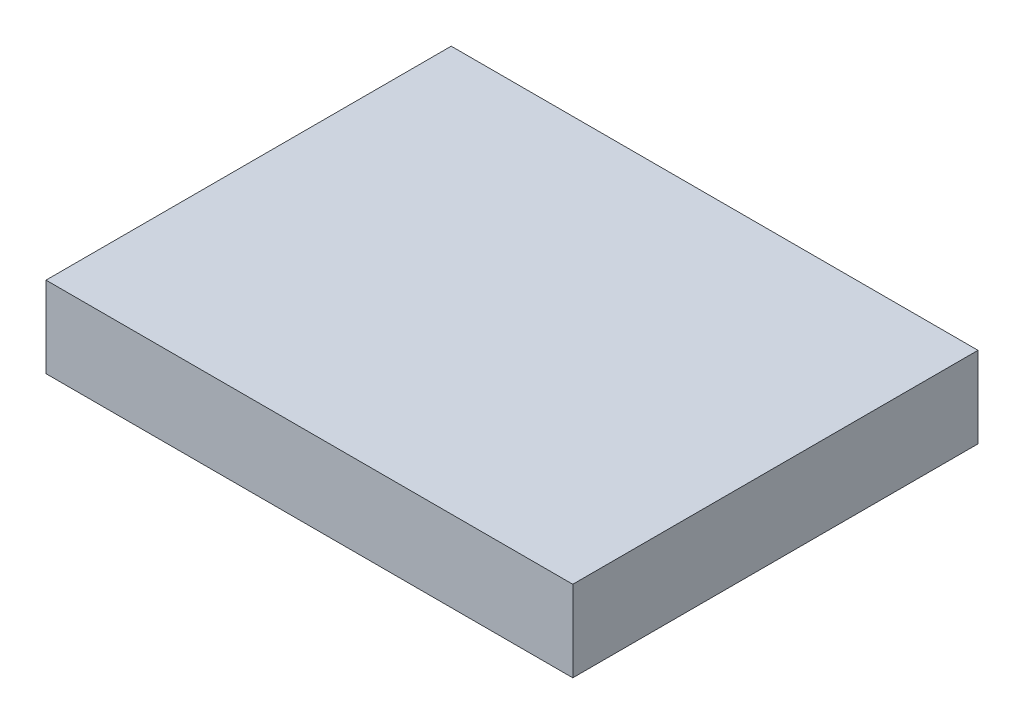
ISO-10303-21;
HEADER;
FILE_DESCRIPTION(('STEP AP214'),'2;1');
FILE_NAME('part.step','',(''),(''),'','','');
FILE_SCHEMA(('AUTOMOTIVE_DESIGN { 1 0 10303 214 1 1 1 1 }'));
ENDSEC;
DATA;
#1=APPLICATION_CONTEXT('core data for automotive mechanical design processes');
#2=APPLICATION_PROTOCOL_DEFINITION('international standard','automotive_design',2000,#1);
#3=PRODUCT_CONTEXT('',#1,'mechanical');
#4=PRODUCT('Part','Part','',(#3));
#5=PRODUCT_RELATED_PRODUCT_CATEGORY('part','',(#4));
#6=PRODUCT_DEFINITION_FORMATION('','',#4);
#7=PRODUCT_DEFINITION_CONTEXT('part definition',#1,'design');
#8=PRODUCT_DEFINITION('design','',#6,#7);
#9=PRODUCT_DEFINITION_SHAPE('','',#8);
#10=(LENGTH_UNIT() NAMED_UNIT(*) SI_UNIT(.MILLI.,.METRE.));
#11=(NAMED_UNIT(*) PLANE_ANGLE_UNIT() SI_UNIT($,.RADIAN.));
#12=(NAMED_UNIT(*) SI_UNIT($,.STERADIAN.) SOLID_ANGLE_UNIT());
#13=UNCERTAINTY_MEASURE_WITH_UNIT(LENGTH_MEASURE(1.E-05),#10,'distance_accuracy_value','');
#14=(GEOMETRIC_REPRESENTATION_CONTEXT(3) GLOBAL_UNCERTAINTY_ASSIGNED_CONTEXT((#13)) GLOBAL_UNIT_ASSIGNED_CONTEXT((#10,
#11,#12)) REPRESENTATION_CONTEXT('',''));
#15=CARTESIAN_POINT('',(0.,0.,0.));
#16=DIRECTION('',(0.,0.,1.));
#17=DIRECTION('',(1.,0.,0.));
#18=AXIS2_PLACEMENT_3D('',#15,#16,#17);
#19=CARTESIAN_POINT('',(80.1944806627111,-10.,-50.));
#20=DIRECTION('',(1.,0.,0.));
#21=DIRECTION('',(0.,0.,-1.));
#22=AXIS2_PLACEMENT_3D('',#19,#20,#21);
#23=PLANE('',#22);
#24=DIRECTION('',(0.,1.,0.));
#25=VECTOR('',#24,1.);
#26=CARTESIAN_POINT('',(80.1944806627111,-10.,-50.));
#27=LINE('',#26,#25);
#28=CARTESIAN_POINT('',(80.1944806627111,-10.,-50.));
#29=VERTEX_POINT('',#28);
#30=CARTESIAN_POINT('',(80.1944806627111,10.,-50.));
#31=VERTEX_POINT('',#30);
#32=EDGE_CURVE('E36',#29,#31,#27,.T.);
#33=ORIENTED_EDGE('',*,*,#32,.T.);
#34=DIRECTION('',(0.,0.,-1.));
#35=VECTOR('',#34,1.);
#36=CARTESIAN_POINT('',(80.1944806627111,10.,-50.));
#37=LINE('',#36,#35);
#38=CARTESIAN_POINT('',(80.1944806627111,10.,50.));
#39=VERTEX_POINT('',#38);
#40=EDGE_CURVE('E73',#39,#31,#37,.T.);
#41=ORIENTED_EDGE('',*,*,#40,.F.);
#42=DIRECTION('',(0.,1.,0.));
#43=VECTOR('',#42,1.);
#44=CARTESIAN_POINT('',(80.1944806627111,-10.,50.));
#45=LINE('',#44,#43);
#46=CARTESIAN_POINT('',(80.1944806627111,-10.,50.));
#47=VERTEX_POINT('',#46);
#48=EDGE_CURVE('E11',#47,#39,#45,.T.);
#49=ORIENTED_EDGE('',*,*,#48,.F.);
#50=DIRECTION('',(0.,0.,-1.));
#51=VECTOR('',#50,1.);
#52=CARTESIAN_POINT('',(80.1944806627111,-10.,-50.));
#53=LINE('',#52,#51);
#54=EDGE_CURVE('E74',#47,#29,#53,.T.);
#55=ORIENTED_EDGE('',*,*,#54,.T.);
#56=EDGE_LOOP('',(#33,#41,#49,#55));
#57=FACE_BOUND('',#56,.T.);
#58=ADVANCED_FACE('F33',(#57),#23,.T.);
#59=CARTESIAN_POINT('',(-49.8055193372889,-10.,50.));
#60=DIRECTION('',(0.,0.,1.));
#61=DIRECTION('',(1.,0.,0.));
#62=AXIS2_PLACEMENT_3D('',#59,#60,#61);
#63=PLANE('',#62);
#64=ORIENTED_EDGE('',*,*,#48,.T.);
#65=DIRECTION('',(1.,0.,0.));
#66=VECTOR('',#65,1.);
#67=CARTESIAN_POINT('',(-49.8055193372889,10.,50.));
#68=LINE('',#67,#66);
#69=CARTESIAN_POINT('',(-49.8055193372889,10.,50.));
#70=VERTEX_POINT('',#69);
#71=EDGE_CURVE('E90',#70,#39,#68,.T.);
#72=ORIENTED_EDGE('',*,*,#71,.F.);
#73=DIRECTION('',(0.,1.,0.));
#74=VECTOR('',#73,1.);
#75=CARTESIAN_POINT('',(-49.8055193372889,-10.,50.));
#76=LINE('',#75,#74);
#77=CARTESIAN_POINT('',(-49.8055193372889,-10.,50.));
#78=VERTEX_POINT('',#77);
#79=EDGE_CURVE('E41',#78,#70,#76,.T.);
#80=ORIENTED_EDGE('',*,*,#79,.F.);
#81=DIRECTION('',(1.,0.,0.));
#82=VECTOR('',#81,1.);
#83=CARTESIAN_POINT('',(-49.8055193372889,-10.,50.));
#84=LINE('',#83,#82);
#85=EDGE_CURVE('E79',#78,#47,#84,.T.);
#86=ORIENTED_EDGE('',*,*,#85,.T.);
#87=EDGE_LOOP('',(#64,#72,#80,#86));
#88=FACE_BOUND('',#87,.T.);
#89=ADVANCED_FACE('F105',(#88),#63,.T.);
#90=CARTESIAN_POINT('',(-49.8055193372889,-10.,-50.));
#91=DIRECTION('',(-1.,0.,0.));
#92=DIRECTION('',(0.,0.,1.));
#93=AXIS2_PLACEMENT_3D('',#90,#91,#92);
#94=PLANE('',#93);
#95=ORIENTED_EDGE('',*,*,#79,.T.);
#96=DIRECTION('',(0.,0.,1.));
#97=VECTOR('',#96,1.);
#98=CARTESIAN_POINT('',(-49.8055193372889,10.,-50.));
#99=LINE('',#98,#97);
#100=CARTESIAN_POINT('',(-49.8055193372889,10.,-50.));
#101=VERTEX_POINT('',#100);
#102=EDGE_CURVE('E86',#101,#70,#99,.T.);
#103=ORIENTED_EDGE('',*,*,#102,.F.);
#104=DIRECTION('',(0.,1.,0.));
#105=VECTOR('',#104,1.);
#106=CARTESIAN_POINT('',(-49.8055193372889,-10.,-50.));
#107=LINE('',#106,#105);
#108=CARTESIAN_POINT('',(-49.8055193372889,-10.,-50.));
#109=VERTEX_POINT('',#108);
#110=EDGE_CURVE('E78',#109,#101,#107,.T.);
#111=ORIENTED_EDGE('',*,*,#110,.F.);
#112=DIRECTION('',(0.,0.,1.));
#113=VECTOR('',#112,1.);
#114=CARTESIAN_POINT('',(-49.8055193372889,-10.,-50.));
#115=LINE('',#114,#113);
#116=EDGE_CURVE('E98',#109,#78,#115,.T.);
#117=ORIENTED_EDGE('',*,*,#116,.T.);
#118=EDGE_LOOP('',(#95,#103,#111,#117));
#119=FACE_BOUND('',#118,.T.);
#120=ADVANCED_FACE('F102',(#119),#94,.T.);
#121=CARTESIAN_POINT('',(-49.8055193372889,-10.,-50.));
#122=DIRECTION('',(0.,0.,-1.));
#123=DIRECTION('',(-1.,0.,0.));
#124=AXIS2_PLACEMENT_3D('',#121,#122,#123);
#125=PLANE('',#124);
#126=ORIENTED_EDGE('',*,*,#110,.T.);
#127=DIRECTION('',(-1.,0.,0.));
#128=VECTOR('',#127,1.);
#129=CARTESIAN_POINT('',(-49.8055193372889,10.,-50.));
#130=LINE('',#129,#128);
#131=EDGE_CURVE('E81',#31,#101,#130,.T.);
#132=ORIENTED_EDGE('',*,*,#131,.F.);
#133=ORIENTED_EDGE('',*,*,#32,.F.);
#134=DIRECTION('',(-1.,0.,0.));
#135=VECTOR('',#134,1.);
#136=CARTESIAN_POINT('',(-49.8055193372889,-10.,-50.));
#137=LINE('',#136,#135);
#138=EDGE_CURVE('E96',#29,#109,#137,.T.);
#139=ORIENTED_EDGE('',*,*,#138,.T.);
#140=EDGE_LOOP('',(#126,#132,#133,#139));
#141=FACE_BOUND('',#140,.T.);
#142=ADVANCED_FACE('F82',(#141),#125,.T.);
#143=CARTESIAN_POINT('',(0.,-10.,0.));
#144=DIRECTION('',(0.,1.,0.));
#145=DIRECTION('',(0.,0.,1.));
#146=AXIS2_PLACEMENT_3D('',#143,#144,#145);
#147=PLANE('',#146);
#148=ORIENTED_EDGE('',*,*,#54,.F.);
#149=ORIENTED_EDGE('',*,*,#85,.F.);
#150=ORIENTED_EDGE('',*,*,#116,.F.);
#151=ORIENTED_EDGE('',*,*,#138,.F.);
#152=EDGE_LOOP('',(#148,#149,#150,#151));
#153=FACE_BOUND('',#152,.T.);
#154=ADVANCED_FACE('F107',(#153),#147,.F.);
#155=CARTESIAN_POINT('',(0.,10.,0.));
#156=DIRECTION('',(0.,1.,0.));
#157=DIRECTION('',(0.,0.,1.));
#158=AXIS2_PLACEMENT_3D('',#155,#156,#157);
#159=PLANE('',#158);
#160=ORIENTED_EDGE('',*,*,#40,.T.);
#161=ORIENTED_EDGE('',*,*,#131,.T.);
#162=ORIENTED_EDGE('',*,*,#102,.T.);
#163=ORIENTED_EDGE('',*,*,#71,.T.);
#164=EDGE_LOOP('',(#160,#161,#162,#163));
#165=FACE_BOUND('',#164,.T.);
#166=ADVANCED_FACE('F89',(#165),#159,.T.);
#167=CLOSED_SHELL('',(#58,#89,#120,#142,#154,#166));
#168=MANIFOLD_SOLID_BREP('B2',#167);
#169=ADVANCED_BREP_SHAPE_REPRESENTATION('',(#18,#168),#14);
#170=SHAPE_DEFINITION_REPRESENTATION(#9,#169);
ENDSEC;
END-ISO-10303-21;
